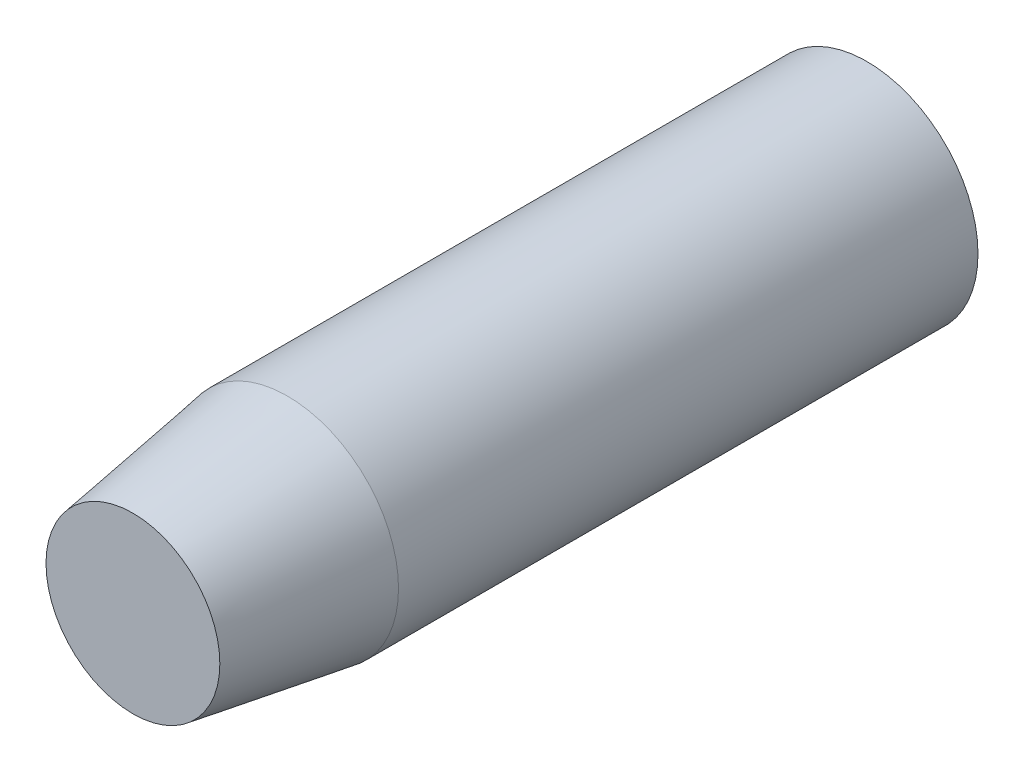
ISO-10303-21;
HEADER;
FILE_DESCRIPTION(('STEP AP214'),'2;1');
FILE_NAME('part.step','',(''),(''),'','','');
FILE_SCHEMA(('AUTOMOTIVE_DESIGN { 1 0 10303 214 1 1 1 1 }'));
ENDSEC;
DATA;
#1=APPLICATION_CONTEXT('core data for automotive mechanical design processes');
#2=APPLICATION_PROTOCOL_DEFINITION('international standard','automotive_design',2000,#1);
#3=PRODUCT_CONTEXT('',#1,'mechanical');
#4=PRODUCT('Part','Part','',(#3));
#5=PRODUCT_RELATED_PRODUCT_CATEGORY('part','',(#4));
#6=PRODUCT_DEFINITION_FORMATION('','',#4);
#7=PRODUCT_DEFINITION_CONTEXT('part definition',#1,'design');
#8=PRODUCT_DEFINITION('design','',#6,#7);
#9=PRODUCT_DEFINITION_SHAPE('','',#8);
#10=(LENGTH_UNIT() NAMED_UNIT(*) SI_UNIT(.MILLI.,.METRE.));
#11=(NAMED_UNIT(*) PLANE_ANGLE_UNIT() SI_UNIT($,.RADIAN.));
#12=(NAMED_UNIT(*) SI_UNIT($,.STERADIAN.) SOLID_ANGLE_UNIT());
#13=UNCERTAINTY_MEASURE_WITH_UNIT(LENGTH_MEASURE(1.E-05),#10,'distance_accuracy_value','');
#14=(GEOMETRIC_REPRESENTATION_CONTEXT(3) GLOBAL_UNCERTAINTY_ASSIGNED_CONTEXT((#13)) GLOBAL_UNIT_ASSIGNED_CONTEXT((#10,
#11,#12)) REPRESENTATION_CONTEXT('',''));
#15=CARTESIAN_POINT('',(0.,0.,0.));
#16=DIRECTION('',(0.,0.,1.));
#17=DIRECTION('',(1.,0.,0.));
#18=AXIS2_PLACEMENT_3D('',#15,#16,#17);
#19=CARTESIAN_POINT('',(0.,0.,60.325));
#20=DIRECTION('',(0.,0.,-1.));
#21=DIRECTION('',(-1.,0.,0.));
#22=AXIS2_PLACEMENT_3D('',#19,#20,#21);
#23=CYLINDRICAL_SURFACE('',#22,18.25625);
#24=CARTESIAN_POINT('',(0.,0.,34.9250000000015));
#25=DIRECTION('',(0.,0.,1.));
#26=DIRECTION('',(1.,0.,0.));
#27=AXIS2_PLACEMENT_3D('',#24,#25,#26);
#28=CIRCLE('',#27,18.25625);
#29=CARTESIAN_POINT('',(18.25625,0.,34.9250000000015));
#30=VERTEX_POINT('',#29);
#31=EDGE_CURVE('E10',#30,#30,#28,.F.);
#32=ORIENTED_EDGE('',*,*,#31,.T.);
#33=EDGE_LOOP('',(#32));
#34=FACE_BOUND('',#33,.T.);
#35=CARTESIAN_POINT('',(0.,0.,-60.325));
#36=DIRECTION('',(0.,0.,1.));
#37=DIRECTION('',(1.,0.,0.));
#38=AXIS2_PLACEMENT_3D('',#35,#36,#37);
#39=CIRCLE('',#38,18.25625);
#40=CARTESIAN_POINT('',(18.25625,0.,-60.325));
#41=VERTEX_POINT('',#40);
#42=EDGE_CURVE('E46',#41,#41,#39,.T.);
#43=ORIENTED_EDGE('',*,*,#42,.T.);
#44=EDGE_LOOP('',(#43));
#45=FACE_BOUND('',#44,.T.);
#46=ADVANCED_FACE('F35',(#34,#45),#23,.T.);
#47=CARTESIAN_POINT('',(0.,0.,60.325));
#48=DIRECTION('',(0.,0.,1.));
#49=DIRECTION('',(1.,0.,0.));
#50=AXIS2_PLACEMENT_3D('',#47,#48,#49);
#51=PLANE('',#50);
#52=CARTESIAN_POINT('',(0.,0.,60.325));
#53=DIRECTION('',(0.,0.,1.));
#54=DIRECTION('',(1.,0.,0.));
#55=AXIS2_PLACEMENT_3D('',#52,#53,#54);
#56=CIRCLE('',#55,14.2875000000003);
#57=CARTESIAN_POINT('',(14.2875000000003,0.,60.325));
#58=VERTEX_POINT('',#57);
#59=EDGE_CURVE('E42',#58,#58,#56,.T.);
#60=ORIENTED_EDGE('',*,*,#59,.T.);
#61=EDGE_LOOP('',(#60));
#62=FACE_BOUND('',#61,.T.);
#63=ADVANCED_FACE('F56',(#62),#51,.T.);
#64=CARTESIAN_POINT('',(0.,0.,-60.325));
#65=DIRECTION('',(0.,0.,1.));
#66=DIRECTION('',(1.,0.,0.));
#67=AXIS2_PLACEMENT_3D('',#64,#65,#66);
#68=PLANE('',#67);
#69=ORIENTED_EDGE('',*,*,#42,.F.);
#70=EDGE_LOOP('',(#69));
#71=FACE_BOUND('',#70,.T.);
#72=ADVANCED_FACE('F54',(#71),#68,.F.);
#73=CARTESIAN_POINT('',(0.,0.,60.325));
#74=DIRECTION('',(0.,0.,-1.));
#75=DIRECTION('',(-1.,0.,0.));
#76=AXIS2_PLACEMENT_3D('',#73,#74,#75);
#77=CONICAL_SURFACE('',#76,14.2875000000003,0.154996741923938);
#78=ORIENTED_EDGE('',*,*,#31,.F.);
#79=EDGE_LOOP('',(#78));
#80=FACE_BOUND('',#79,.T.);
#81=ORIENTED_EDGE('',*,*,#59,.F.);
#82=EDGE_LOOP('',(#81));
#83=FACE_BOUND('',#82,.T.);
#84=ADVANCED_FACE('F37',(#80,#83),#77,.T.);
#85=CLOSED_SHELL('',(#46,#63,#72,#84));
#86=MANIFOLD_SOLID_BREP('B2',#85);
#87=ADVANCED_BREP_SHAPE_REPRESENTATION('',(#18,#86),#14);
#88=SHAPE_DEFINITION_REPRESENTATION(#9,#87);
ENDSEC;
END-ISO-10303-21;
